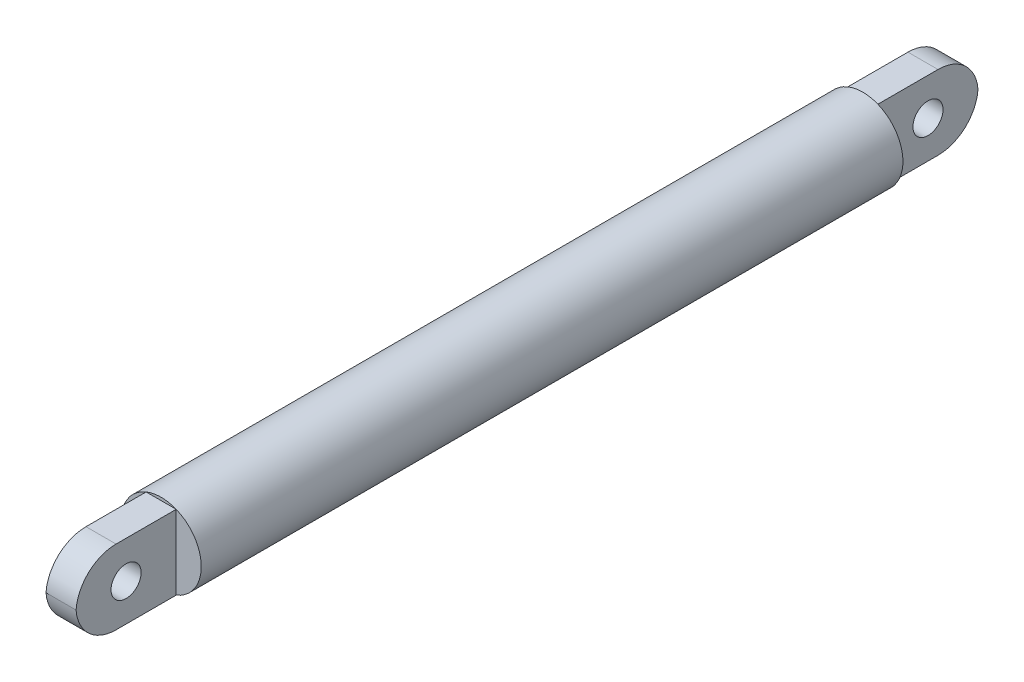
ISO-10303-21;
HEADER;
FILE_DESCRIPTION(('STEP AP214'),'2;1');
FILE_NAME('part.step','',(''),(''),'','','');
FILE_SCHEMA(('AUTOMOTIVE_DESIGN { 1 0 10303 214 1 1 1 1 }'));
ENDSEC;
DATA;
#1=APPLICATION_CONTEXT('core data for automotive mechanical design processes');
#2=APPLICATION_PROTOCOL_DEFINITION('international standard','automotive_design',2000,#1);
#3=PRODUCT_CONTEXT('',#1,'mechanical');
#4=PRODUCT('Part','Part','',(#3));
#5=PRODUCT_RELATED_PRODUCT_CATEGORY('part','',(#4));
#6=PRODUCT_DEFINITION_FORMATION('','',#4);
#7=PRODUCT_DEFINITION_CONTEXT('part definition',#1,'design');
#8=PRODUCT_DEFINITION('design','',#6,#7);
#9=PRODUCT_DEFINITION_SHAPE('','',#8);
#10=(LENGTH_UNIT() NAMED_UNIT(*) SI_UNIT(.MILLI.,.METRE.));
#11=(NAMED_UNIT(*) PLANE_ANGLE_UNIT() SI_UNIT($,.RADIAN.));
#12=(NAMED_UNIT(*) SI_UNIT($,.STERADIAN.) SOLID_ANGLE_UNIT());
#13=UNCERTAINTY_MEASURE_WITH_UNIT(LENGTH_MEASURE(1.E-05),#10,'distance_accuracy_value','');
#14=(GEOMETRIC_REPRESENTATION_CONTEXT(3) GLOBAL_UNCERTAINTY_ASSIGNED_CONTEXT((#13)) GLOBAL_UNIT_ASSIGNED_CONTEXT((#10,
#11,#12)) REPRESENTATION_CONTEXT('',''));
#15=CARTESIAN_POINT('',(0.,0.,0.));
#16=DIRECTION('',(0.,0.,1.));
#17=DIRECTION('',(1.,0.,0.));
#18=AXIS2_PLACEMENT_3D('',#15,#16,#17);
#19=CARTESIAN_POINT('',(0.,0.,0.));
#20=DIRECTION('',(0.,0.,1.));
#21=DIRECTION('',(1.,0.,0.));
#22=AXIS2_PLACEMENT_3D('',#19,#20,#21);
#23=PLANE('',#22);
#24=DIRECTION('',(1.,0.,0.));
#25=VECTOR('',#24,1.);
#26=CARTESIAN_POINT('',(0.,3.70809924354783,0.));
#27=LINE('',#26,#25);
#28=CARTESIAN_POINT('',(-1.5,3.70809924354783,0.));
#29=VERTEX_POINT('',#28);
#30=CARTESIAN_POINT('',(1.5,3.70809924354783,0.));
#31=VERTEX_POINT('',#30);
#32=EDGE_CURVE('E151',#29,#31,#27,.T.);
#33=ORIENTED_EDGE('',*,*,#32,.F.);
#34=CARTESIAN_POINT('',(0.,0.,0.));
#35=DIRECTION('',(0.,0.,1.));
#36=DIRECTION('',(1.,0.,0.));
#37=AXIS2_PLACEMENT_3D('',#34,#35,#36);
#38=CIRCLE('',#37,4.);
#39=EDGE_CURVE('E162',#31,#29,#38,.T.);
#40=ORIENTED_EDGE('',*,*,#39,.F.);
#41=EDGE_LOOP('',(#33,#40));
#42=FACE_BOUND('',#41,.T.);
#43=ADVANCED_FACE('F45',(#42),#23,.F.);
#44=DIRECTION('',(0.,1.,0.));
#45=VECTOR('',#44,1.);
#46=CARTESIAN_POINT('',(-1.5,0.,0.));
#47=LINE('',#46,#45);
#48=CARTESIAN_POINT('',(-1.5,-3.70809924354783,0.));
#49=VERTEX_POINT('',#48);
#50=EDGE_CURVE('E125',#49,#29,#47,.T.);
#51=ORIENTED_EDGE('',*,*,#50,.F.);
#52=EDGE_CURVE('E149',#29,#49,#38,.T.);
#53=ORIENTED_EDGE('',*,*,#52,.F.);
#54=EDGE_LOOP('',(#51,#53));
#55=FACE_BOUND('',#54,.T.);
#56=ADVANCED_FACE('F147',(#55),#23,.F.);
#57=CARTESIAN_POINT('',(1.5,-3.70809924354783,0.));
#58=VERTEX_POINT('',#57);
#59=EDGE_CURVE('E158',#58,#31,#38,.T.);
#60=ORIENTED_EDGE('',*,*,#59,.F.);
#61=DIRECTION('',(0.,1.,0.));
#62=VECTOR('',#61,1.);
#63=CARTESIAN_POINT('',(1.5,0.,0.));
#64=LINE('',#63,#62);
#65=EDGE_CURVE('E143',#58,#31,#64,.T.);
#66=ORIENTED_EDGE('',*,*,#65,.T.);
#67=EDGE_LOOP('',(#60,#66));
#68=FACE_BOUND('',#67,.T.);
#69=ADVANCED_FACE('F268',(#68),#23,.F.);
#70=CARTESIAN_POINT('',(0.,0.,70.));
#71=DIRECTION('',(0.,0.,1.));
#72=DIRECTION('',(1.,0.,0.));
#73=AXIS2_PLACEMENT_3D('',#70,#71,#72);
#74=PLANE('',#73);
#75=CARTESIAN_POINT('',(0.,0.,70.));
#76=DIRECTION('',(0.,0.,1.));
#77=DIRECTION('',(1.,0.,0.));
#78=AXIS2_PLACEMENT_3D('',#75,#76,#77);
#79=CIRCLE('',#78,4.);
#80=CARTESIAN_POINT('',(-1.5,3.70809924354783,70.));
#81=VERTEX_POINT('',#80);
#82=CARTESIAN_POINT('',(-1.5,-3.70809924354783,70.));
#83=VERTEX_POINT('',#82);
#84=EDGE_CURVE('E336',#81,#83,#79,.T.);
#85=ORIENTED_EDGE('',*,*,#84,.T.);
#86=DIRECTION('',(0.,1.,0.));
#87=VECTOR('',#86,1.);
#88=CARTESIAN_POINT('',(-1.5,0.,70.));
#89=LINE('',#88,#87);
#90=EDGE_CURVE('E228',#83,#81,#89,.T.);
#91=ORIENTED_EDGE('',*,*,#90,.T.);
#92=EDGE_LOOP('',(#85,#91));
#93=FACE_BOUND('',#92,.T.);
#94=ADVANCED_FACE('F277',(#93),#74,.T.);
#95=CARTESIAN_POINT('',(1.5,3.70809924354783,70.));
#96=VERTEX_POINT('',#95);
#97=EDGE_CURVE('E166',#96,#81,#79,.T.);
#98=ORIENTED_EDGE('',*,*,#97,.T.);
#99=DIRECTION('',(1.,0.,0.));
#100=VECTOR('',#99,1.);
#101=CARTESIAN_POINT('',(0.,3.70809924354783,70.));
#102=LINE('',#101,#100);
#103=EDGE_CURVE('E231',#81,#96,#102,.T.);
#104=ORIENTED_EDGE('',*,*,#103,.T.);
#105=EDGE_LOOP('',(#98,#104));
#106=FACE_BOUND('',#105,.T.);
#107=ADVANCED_FACE('F284',(#106),#74,.T.);
#108=DIRECTION('',(1.,0.,0.));
#109=VECTOR('',#108,1.);
#110=CARTESIAN_POINT('',(0.,-3.70809924354783,70.));
#111=LINE('',#110,#109);
#112=CARTESIAN_POINT('',(1.5,-3.70809924354783,70.));
#113=VERTEX_POINT('',#112);
#114=EDGE_CURVE('E235',#83,#113,#111,.T.);
#115=ORIENTED_EDGE('',*,*,#114,.F.);
#116=EDGE_CURVE('E331',#83,#113,#79,.T.);
#117=ORIENTED_EDGE('',*,*,#116,.T.);
#118=EDGE_LOOP('',(#115,#117));
#119=FACE_BOUND('',#118,.T.);
#120=ADVANCED_FACE('F278',(#119),#74,.T.);
#121=CARTESIAN_POINT('',(0.,0.,70.));
#122=DIRECTION('',(0.,0.,-1.));
#123=DIRECTION('',(-1.,0.,0.));
#124=AXIS2_PLACEMENT_3D('',#121,#122,#123);
#125=CYLINDRICAL_SURFACE('',#124,4.);
#126=ORIENTED_EDGE('',*,*,#97,.F.);
#127=EDGE_CURVE('E163',#113,#96,#79,.T.);
#128=ORIENTED_EDGE('',*,*,#127,.F.);
#129=ORIENTED_EDGE('',*,*,#116,.F.);
#130=ORIENTED_EDGE('',*,*,#84,.F.);
#131=EDGE_LOOP('',(#126,#128,#129,#130));
#132=FACE_BOUND('',#131,.T.);
#133=ORIENTED_EDGE('',*,*,#39,.T.);
#134=ORIENTED_EDGE('',*,*,#52,.T.);
#135=EDGE_CURVE('E154',#49,#58,#38,.T.);
#136=ORIENTED_EDGE('',*,*,#135,.T.);
#137=ORIENTED_EDGE('',*,*,#59,.T.);
#138=EDGE_LOOP('',(#133,#134,#136,#137));
#139=FACE_BOUND('',#138,.T.);
#140=ADVANCED_FACE('F160',(#132,#139),#125,.T.);
#141=DIRECTION('',(0.,1.,0.));
#142=VECTOR('',#141,1.);
#143=CARTESIAN_POINT('',(1.5,0.,70.));
#144=LINE('',#143,#142);
#145=EDGE_CURVE('E221',#113,#96,#144,.T.);
#146=ORIENTED_EDGE('',*,*,#145,.F.);
#147=ORIENTED_EDGE('',*,*,#127,.T.);
#148=EDGE_LOOP('',(#146,#147));
#149=FACE_BOUND('',#148,.T.);
#150=ADVANCED_FACE('F272',(#149),#74,.T.);
#151=ORIENTED_EDGE('',*,*,#135,.F.);
#152=DIRECTION('',(1.,0.,0.));
#153=VECTOR('',#152,1.);
#154=CARTESIAN_POINT('',(0.,-3.70809924354783,0.));
#155=LINE('',#154,#153);
#156=EDGE_CURVE('E136',#49,#58,#155,.T.);
#157=ORIENTED_EDGE('',*,*,#156,.T.);
#158=EDGE_LOOP('',(#151,#157));
#159=FACE_BOUND('',#158,.T.);
#160=ADVANCED_FACE('F155',(#159),#23,.F.);
#161=CARTESIAN_POINT('',(0.,-3.70809924354783,80.));
#162=DIRECTION('',(0.,1.,0.));
#163=DIRECTION('',(0.,0.,1.));
#164=AXIS2_PLACEMENT_3D('',#161,#162,#163);
#165=PLANE('',#164);
#166=DIRECTION('',(0.,0.,-1.));
#167=VECTOR('',#166,1.);
#168=CARTESIAN_POINT('',(1.5,-3.70809924354783,80.));
#169=LINE('',#168,#167);
#170=CARTESIAN_POINT('',(1.5,-3.70809924354783,76.));
#171=VERTEX_POINT('',#170);
#172=EDGE_CURVE('E222',#171,#113,#169,.T.);
#173=ORIENTED_EDGE('',*,*,#172,.F.);
#174=DIRECTION('',(1.,0.,0.));
#175=VECTOR('',#174,1.);
#176=CARTESIAN_POINT('',(-1.5,-3.70809924354783,76.));
#177=LINE('',#176,#175);
#178=CARTESIAN_POINT('',(-1.5,-3.70809924354783,76.));
#179=VERTEX_POINT('',#178);
#180=EDGE_CURVE('E190',#171,#179,#177,.F.);
#181=ORIENTED_EDGE('',*,*,#180,.T.);
#182=DIRECTION('',(0.,0.,-1.));
#183=VECTOR('',#182,1.);
#184=CARTESIAN_POINT('',(-1.5,-3.70809924354783,80.));
#185=LINE('',#184,#183);
#186=EDGE_CURVE('E224',#179,#83,#185,.T.);
#187=ORIENTED_EDGE('',*,*,#186,.T.);
#188=ORIENTED_EDGE('',*,*,#114,.T.);
#189=EDGE_LOOP('',(#173,#181,#187,#188));
#190=FACE_BOUND('',#189,.T.);
#191=ADVANCED_FACE('F252',(#190),#165,.F.);
#192=CARTESIAN_POINT('',(1.5,0.,80.));
#193=DIRECTION('',(-1.,0.,0.));
#194=DIRECTION('',(0.,0.,1.));
#195=AXIS2_PLACEMENT_3D('',#192,#193,#194);
#196=PLANE('',#195);
#197=CARTESIAN_POINT('',(1.5,0.,75.));
#198=DIRECTION('',(1.,0.,0.));
#199=DIRECTION('',(0.,0.,-1.));
#200=AXIS2_PLACEMENT_3D('',#197,#198,#199);
#201=CIRCLE('',#200,1.5);
#202=CARTESIAN_POINT('',(1.5,0.,73.5));
#203=VERTEX_POINT('',#202);
#204=EDGE_CURVE('E172',#203,#203,#201,.T.);
#205=ORIENTED_EDGE('',*,*,#204,.F.);
#206=EDGE_LOOP('',(#205));
#207=FACE_BOUND('',#206,.T.);
#208=CARTESIAN_POINT('',(1.5,-0.291900756452169,76.));
#209=DIRECTION('',(-1.,0.,0.));
#210=DIRECTION('',(0.,0.,1.));
#211=AXIS2_PLACEMENT_3D('',#208,#209,#210);
#212=CIRCLE('',#211,4.);
#213=CARTESIAN_POINT('',(1.5,3.70809924354783,76.));
#214=VERTEX_POINT('',#213);
#215=CARTESIAN_POINT('',(1.5,0.,79.9893350258386));
#216=VERTEX_POINT('',#215);
#217=EDGE_CURVE('E186',#214,#216,#212,.F.);
#218=ORIENTED_EDGE('',*,*,#217,.T.);
#219=CARTESIAN_POINT('',(1.5,0.291900756452169,76.));
#220=DIRECTION('',(-1.,0.,0.));
#221=DIRECTION('',(0.,0.,1.));
#222=AXIS2_PLACEMENT_3D('',#219,#220,#221);
#223=CIRCLE('',#222,4.);
#224=EDGE_CURVE('E188',#216,#171,#223,.F.);
#225=ORIENTED_EDGE('',*,*,#224,.T.);
#226=ORIENTED_EDGE('',*,*,#172,.T.);
#227=ORIENTED_EDGE('',*,*,#145,.T.);
#228=DIRECTION('',(0.,0.,-1.));
#229=VECTOR('',#228,1.);
#230=CARTESIAN_POINT('',(1.5,3.70809924354783,80.));
#231=LINE('',#230,#229);
#232=EDGE_CURVE('E214',#214,#96,#231,.T.);
#233=ORIENTED_EDGE('',*,*,#232,.F.);
#234=EDGE_LOOP('',(#218,#225,#226,#227,#233));
#235=FACE_BOUND('',#234,.T.);
#236=ADVANCED_FACE('F219',(#207,#235),#196,.F.);
#237=CARTESIAN_POINT('',(0.,3.70809924354783,80.));
#238=DIRECTION('',(0.,1.,0.));
#239=DIRECTION('',(0.,0.,1.));
#240=AXIS2_PLACEMENT_3D('',#237,#238,#239);
#241=PLANE('',#240);
#242=DIRECTION('',(0.,0.,-1.));
#243=VECTOR('',#242,1.);
#244=CARTESIAN_POINT('',(-1.5,3.70809924354783,80.));
#245=LINE('',#244,#243);
#246=CARTESIAN_POINT('',(-1.5,3.70809924354783,76.));
#247=VERTEX_POINT('',#246);
#248=EDGE_CURVE('E216',#247,#81,#245,.T.);
#249=ORIENTED_EDGE('',*,*,#248,.F.);
#250=DIRECTION('',(1.,0.,0.));
#251=VECTOR('',#250,1.);
#252=CARTESIAN_POINT('',(0.,3.70809924354783,76.));
#253=LINE('',#252,#251);
#254=EDGE_CURVE('E11',#247,#214,#253,.T.);
#255=ORIENTED_EDGE('',*,*,#254,.T.);
#256=ORIENTED_EDGE('',*,*,#232,.T.);
#257=ORIENTED_EDGE('',*,*,#103,.F.);
#258=EDGE_LOOP('',(#249,#255,#256,#257));
#259=FACE_BOUND('',#258,.T.);
#260=ADVANCED_FACE('F212',(#259),#241,.T.);
#261=CARTESIAN_POINT('',(-1.5,0.,80.));
#262=DIRECTION('',(-1.,0.,0.));
#263=DIRECTION('',(0.,0.,1.));
#264=AXIS2_PLACEMENT_3D('',#261,#262,#263);
#265=PLANE('',#264);
#266=CARTESIAN_POINT('',(-1.5,0.,75.));
#267=DIRECTION('',(-1.,0.,0.));
#268=DIRECTION('',(0.,0.,1.));
#269=AXIS2_PLACEMENT_3D('',#266,#267,#268);
#270=CIRCLE('',#269,1.5);
#271=CARTESIAN_POINT('',(-1.5,0.,76.5));
#272=VERTEX_POINT('',#271);
#273=EDGE_CURVE('E171',#272,#272,#270,.T.);
#274=ORIENTED_EDGE('',*,*,#273,.F.);
#275=EDGE_LOOP('',(#274));
#276=FACE_BOUND('',#275,.T.);
#277=ORIENTED_EDGE('',*,*,#186,.F.);
#278=CARTESIAN_POINT('',(-1.5,0.291900756452169,76.));
#279=DIRECTION('',(-1.,0.,0.));
#280=DIRECTION('',(0.,0.,1.));
#281=AXIS2_PLACEMENT_3D('',#278,#279,#280);
#282=CIRCLE('',#281,4.);
#283=CARTESIAN_POINT('',(-1.5,0.,79.9893350258386));
#284=VERTEX_POINT('',#283);
#285=EDGE_CURVE('E54',#179,#284,#282,.T.);
#286=ORIENTED_EDGE('',*,*,#285,.T.);
#287=CARTESIAN_POINT('',(-1.5,-0.291900756452169,76.));
#288=DIRECTION('',(-1.,0.,0.));
#289=DIRECTION('',(0.,0.,1.));
#290=AXIS2_PLACEMENT_3D('',#287,#288,#289);
#291=CIRCLE('',#290,4.);
#292=EDGE_CURVE('E65',#284,#247,#291,.T.);
#293=ORIENTED_EDGE('',*,*,#292,.T.);
#294=ORIENTED_EDGE('',*,*,#248,.T.);
#295=ORIENTED_EDGE('',*,*,#90,.F.);
#296=EDGE_LOOP('',(#277,#286,#293,#294,#295));
#297=FACE_BOUND('',#296,.T.);
#298=ADVANCED_FACE('F258',(#276,#297),#265,.T.);
#299=CARTESIAN_POINT('',(1.5,0.,-10.));
#300=DIRECTION('',(1.,0.,0.));
#301=DIRECTION('',(0.,0.,-1.));
#302=AXIS2_PLACEMENT_3D('',#299,#300,#301);
#303=PLANE('',#302);
#304=CARTESIAN_POINT('',(1.5,0.,-5.));
#305=DIRECTION('',(1.,0.,0.));
#306=DIRECTION('',(0.,0.,-1.));
#307=AXIS2_PLACEMENT_3D('',#304,#305,#306);
#308=CIRCLE('',#307,1.5);
#309=CARTESIAN_POINT('',(1.5,0.,-6.5));
#310=VERTEX_POINT('',#309);
#311=EDGE_CURVE('E196',#310,#310,#308,.T.);
#312=ORIENTED_EDGE('',*,*,#311,.F.);
#313=EDGE_LOOP('',(#312));
#314=FACE_BOUND('',#313,.T.);
#315=DIRECTION('',(0.,0.,1.));
#316=VECTOR('',#315,1.);
#317=CARTESIAN_POINT('',(1.5,-3.70809924354783,-10.));
#318=LINE('',#317,#316);
#319=CARTESIAN_POINT('',(1.5,-3.70809924354783,-6.));
#320=VERTEX_POINT('',#319);
#321=EDGE_CURVE('E132',#320,#58,#318,.T.);
#322=ORIENTED_EDGE('',*,*,#321,.F.);
#323=CARTESIAN_POINT('',(1.5,0.291900756452169,-6.));
#324=DIRECTION('',(1.,0.,0.));
#325=DIRECTION('',(0.,0.,-1.));
#326=AXIS2_PLACEMENT_3D('',#323,#324,#325);
#327=CIRCLE('',#326,4.);
#328=CARTESIAN_POINT('',(1.5,0.,-9.9893350258386));
#329=VERTEX_POINT('',#328);
#330=EDGE_CURVE('E179',#320,#329,#327,.T.);
#331=ORIENTED_EDGE('',*,*,#330,.T.);
#332=CARTESIAN_POINT('',(1.5,-0.291900756452169,-6.));
#333=DIRECTION('',(1.,0.,0.));
#334=DIRECTION('',(0.,0.,-1.));
#335=AXIS2_PLACEMENT_3D('',#332,#333,#334);
#336=CIRCLE('',#335,4.);
#337=CARTESIAN_POINT('',(1.5,3.70809924354783,-6.));
#338=VERTEX_POINT('',#337);
#339=EDGE_CURVE('E177',#329,#338,#336,.T.);
#340=ORIENTED_EDGE('',*,*,#339,.T.);
#341=DIRECTION('',(0.,0.,1.));
#342=VECTOR('',#341,1.);
#343=CARTESIAN_POINT('',(1.5,3.70809924354783,-10.));
#344=LINE('',#343,#342);
#345=EDGE_CURVE('E240',#338,#31,#344,.T.);
#346=ORIENTED_EDGE('',*,*,#345,.T.);
#347=ORIENTED_EDGE('',*,*,#65,.F.);
#348=EDGE_LOOP('',(#322,#331,#340,#346,#347));
#349=FACE_BOUND('',#348,.T.);
#350=ADVANCED_FACE('F296',(#314,#349),#303,.T.);
#351=CARTESIAN_POINT('',(0.,-3.70809924354783,-10.));
#352=DIRECTION('',(0.,-1.,0.));
#353=DIRECTION('',(0.,0.,-1.));
#354=AXIS2_PLACEMENT_3D('',#351,#352,#353);
#355=PLANE('',#354);
#356=DIRECTION('',(0.,0.,1.));
#357=VECTOR('',#356,1.);
#358=CARTESIAN_POINT('',(-1.5,-3.70809924354783,-10.));
#359=LINE('',#358,#357);
#360=CARTESIAN_POINT('',(-1.5,-3.70809924354783,-6.));
#361=VERTEX_POINT('',#360);
#362=EDGE_CURVE('E120',#361,#49,#359,.T.);
#363=ORIENTED_EDGE('',*,*,#362,.F.);
#364=DIRECTION('',(1.,0.,0.));
#365=VECTOR('',#364,1.);
#366=CARTESIAN_POINT('',(0.,-3.70809924354783,-6.));
#367=LINE('',#366,#365);
#368=EDGE_CURVE('E175',#361,#320,#367,.T.);
#369=ORIENTED_EDGE('',*,*,#368,.T.);
#370=ORIENTED_EDGE('',*,*,#321,.T.);
#371=ORIENTED_EDGE('',*,*,#156,.F.);
#372=EDGE_LOOP('',(#363,#369,#370,#371));
#373=FACE_BOUND('',#372,.T.);
#374=ADVANCED_FACE('F137',(#373),#355,.T.);
#375=CARTESIAN_POINT('',(-1.5,0.,-10.));
#376=DIRECTION('',(1.,0.,0.));
#377=DIRECTION('',(0.,0.,-1.));
#378=AXIS2_PLACEMENT_3D('',#375,#376,#377);
#379=PLANE('',#378);
#380=CARTESIAN_POINT('',(-1.5,0.,-5.));
#381=DIRECTION('',(1.,0.,0.));
#382=DIRECTION('',(0.,0.,-1.));
#383=AXIS2_PLACEMENT_3D('',#380,#381,#382);
#384=CIRCLE('',#383,1.5);
#385=CARTESIAN_POINT('',(-1.5,0.,-6.5));
#386=VERTEX_POINT('',#385);
#387=EDGE_CURVE('E168',#386,#386,#384,.T.);
#388=ORIENTED_EDGE('',*,*,#387,.T.);
#389=EDGE_LOOP('',(#388));
#390=FACE_BOUND('',#389,.T.);
#391=CARTESIAN_POINT('',(-1.5,-0.291900756452169,-6.));
#392=DIRECTION('',(1.,0.,0.));
#393=DIRECTION('',(0.,0.,-1.));
#394=AXIS2_PLACEMENT_3D('',#391,#392,#393);
#395=CIRCLE('',#394,4.);
#396=CARTESIAN_POINT('',(-1.5,3.70809924354783,-6.));
#397=VERTEX_POINT('',#396);
#398=CARTESIAN_POINT('',(-1.5,0.,-9.9893350258386));
#399=VERTEX_POINT('',#398);
#400=EDGE_CURVE('E181',#397,#399,#395,.F.);
#401=ORIENTED_EDGE('',*,*,#400,.T.);
#402=CARTESIAN_POINT('',(-1.5,0.291900756452169,-6.));
#403=DIRECTION('',(1.,0.,0.));
#404=DIRECTION('',(0.,0.,-1.));
#405=AXIS2_PLACEMENT_3D('',#402,#403,#404);
#406=CIRCLE('',#405,4.);
#407=EDGE_CURVE('E128',#399,#361,#406,.F.);
#408=ORIENTED_EDGE('',*,*,#407,.T.);
#409=ORIENTED_EDGE('',*,*,#362,.T.);
#410=ORIENTED_EDGE('',*,*,#50,.T.);
#411=DIRECTION('',(0.,0.,1.));
#412=VECTOR('',#411,1.);
#413=CARTESIAN_POINT('',(-1.5,3.70809924354783,-10.));
#414=LINE('',#413,#412);
#415=EDGE_CURVE('E133',#397,#29,#414,.T.);
#416=ORIENTED_EDGE('',*,*,#415,.F.);
#417=EDGE_LOOP('',(#401,#408,#409,#410,#416));
#418=FACE_BOUND('',#417,.T.);
#419=ADVANCED_FACE('F122',(#390,#418),#379,.F.);
#420=CARTESIAN_POINT('',(0.,3.70809924354783,-10.));
#421=DIRECTION('',(0.,-1.,0.));
#422=DIRECTION('',(0.,0.,-1.));
#423=AXIS2_PLACEMENT_3D('',#420,#421,#422);
#424=PLANE('',#423);
#425=ORIENTED_EDGE('',*,*,#345,.F.);
#426=DIRECTION('',(1.,0.,0.));
#427=VECTOR('',#426,1.);
#428=CARTESIAN_POINT('',(-1.5,3.70809924354783,-6.));
#429=LINE('',#428,#427);
#430=EDGE_CURVE('E184',#338,#397,#429,.F.);
#431=ORIENTED_EDGE('',*,*,#430,.T.);
#432=ORIENTED_EDGE('',*,*,#415,.T.);
#433=ORIENTED_EDGE('',*,*,#32,.T.);
#434=EDGE_LOOP('',(#425,#431,#432,#433));
#435=FACE_BOUND('',#434,.T.);
#436=ADVANCED_FACE('F288',(#435),#424,.F.);
#437=CARTESIAN_POINT('',(-4.,0.,-5.));
#438=DIRECTION('',(1.,0.,0.));
#439=DIRECTION('',(0.,0.,-1.));
#440=AXIS2_PLACEMENT_3D('',#437,#438,#439);
#441=CYLINDRICAL_SURFACE('',#440,1.5);
#442=ORIENTED_EDGE('',*,*,#311,.T.);
#443=EDGE_LOOP('',(#442));
#444=FACE_BOUND('',#443,.T.);
#445=ORIENTED_EDGE('',*,*,#387,.F.);
#446=EDGE_LOOP('',(#445));
#447=FACE_BOUND('',#446,.T.);
#448=ADVANCED_FACE('F314',(#444,#447),#441,.F.);
#449=CARTESIAN_POINT('',(-4.,0.,75.));
#450=DIRECTION('',(1.,0.,0.));
#451=DIRECTION('',(0.,0.,-1.));
#452=AXIS2_PLACEMENT_3D('',#449,#450,#451);
#453=CYLINDRICAL_SURFACE('',#452,1.5);
#454=ORIENTED_EDGE('',*,*,#273,.T.);
#455=EDGE_LOOP('',(#454));
#456=FACE_BOUND('',#455,.T.);
#457=ORIENTED_EDGE('',*,*,#204,.T.);
#458=EDGE_LOOP('',(#457));
#459=FACE_BOUND('',#458,.T.);
#460=ADVANCED_FACE('F249',(#456,#459),#453,.F.);
#461=CARTESIAN_POINT('',(0.,-0.291900756452169,-6.));
#462=DIRECTION('',(-1.,0.,0.));
#463=DIRECTION('',(0.,0.,1.));
#464=AXIS2_PLACEMENT_3D('',#461,#462,#463);
#465=CYLINDRICAL_SURFACE('',#464,4.);
#466=DIRECTION('',(-1.,0.,0.));
#467=VECTOR('',#466,1.);
#468=CARTESIAN_POINT('',(0.,0.,-9.9893350258386));
#469=LINE('',#468,#467);
#470=EDGE_CURVE('E194',#399,#329,#469,.F.);
#471=ORIENTED_EDGE('',*,*,#470,.F.);
#472=ORIENTED_EDGE('',*,*,#400,.F.);
#473=ORIENTED_EDGE('',*,*,#430,.F.);
#474=ORIENTED_EDGE('',*,*,#339,.F.);
#475=EDGE_LOOP('',(#471,#472,#473,#474));
#476=FACE_BOUND('',#475,.T.);
#477=ADVANCED_FACE('F292',(#476),#465,.T.);
#478=CARTESIAN_POINT('',(0.,0.291900756452169,-6.));
#479=DIRECTION('',(1.,0.,0.));
#480=DIRECTION('',(0.,0.,-1.));
#481=AXIS2_PLACEMENT_3D('',#478,#479,#480);
#482=CYLINDRICAL_SURFACE('',#481,4.);
#483=ORIENTED_EDGE('',*,*,#407,.F.);
#484=ORIENTED_EDGE('',*,*,#470,.T.);
#485=ORIENTED_EDGE('',*,*,#330,.F.);
#486=ORIENTED_EDGE('',*,*,#368,.F.);
#487=EDGE_LOOP('',(#483,#484,#485,#486));
#488=FACE_BOUND('',#487,.T.);
#489=ADVANCED_FACE('F294',(#488),#482,.T.);
#490=CARTESIAN_POINT('',(0.,-0.291900756452169,76.));
#491=DIRECTION('',(1.,0.,0.));
#492=DIRECTION('',(0.,0.,-1.));
#493=AXIS2_PLACEMENT_3D('',#490,#491,#492);
#494=CYLINDRICAL_SURFACE('',#493,4.);
#495=ORIENTED_EDGE('',*,*,#254,.F.);
#496=ORIENTED_EDGE('',*,*,#292,.F.);
#497=DIRECTION('',(1.,0.,0.));
#498=VECTOR('',#497,1.);
#499=CARTESIAN_POINT('',(0.,0.,79.9893350258386));
#500=LINE('',#499,#498);
#501=EDGE_CURVE('E49',#216,#284,#500,.F.);
#502=ORIENTED_EDGE('',*,*,#501,.F.);
#503=ORIENTED_EDGE('',*,*,#217,.F.);
#504=EDGE_LOOP('',(#495,#496,#502,#503));
#505=FACE_BOUND('',#504,.T.);
#506=ADVANCED_FACE('F47',(#505),#494,.T.);
#507=CARTESIAN_POINT('',(0.,0.291900756452169,76.));
#508=DIRECTION('',(-1.,0.,0.));
#509=DIRECTION('',(0.,0.,1.));
#510=AXIS2_PLACEMENT_3D('',#507,#508,#509);
#511=CYLINDRICAL_SURFACE('',#510,4.);
#512=ORIENTED_EDGE('',*,*,#285,.F.);
#513=ORIENTED_EDGE('',*,*,#180,.F.);
#514=ORIENTED_EDGE('',*,*,#224,.F.);
#515=ORIENTED_EDGE('',*,*,#501,.T.);
#516=EDGE_LOOP('',(#512,#513,#514,#515));
#517=FACE_BOUND('',#516,.T.);
#518=ADVANCED_FACE('F205',(#517),#511,.T.);
#519=CLOSED_SHELL('',(#43,#56,#69,#94,#107,#120,#140,#150,#160,#191,#236,#260,#298,#350,#374,
#419,#436,#448,#460,#477,#489,#506,#518));
#520=MANIFOLD_SOLID_BREP('B2',#519);
#521=ADVANCED_BREP_SHAPE_REPRESENTATION('',(#18,#520),#14);
#522=SHAPE_DEFINITION_REPRESENTATION(#9,#521);
ENDSEC;
END-ISO-10303-21;
